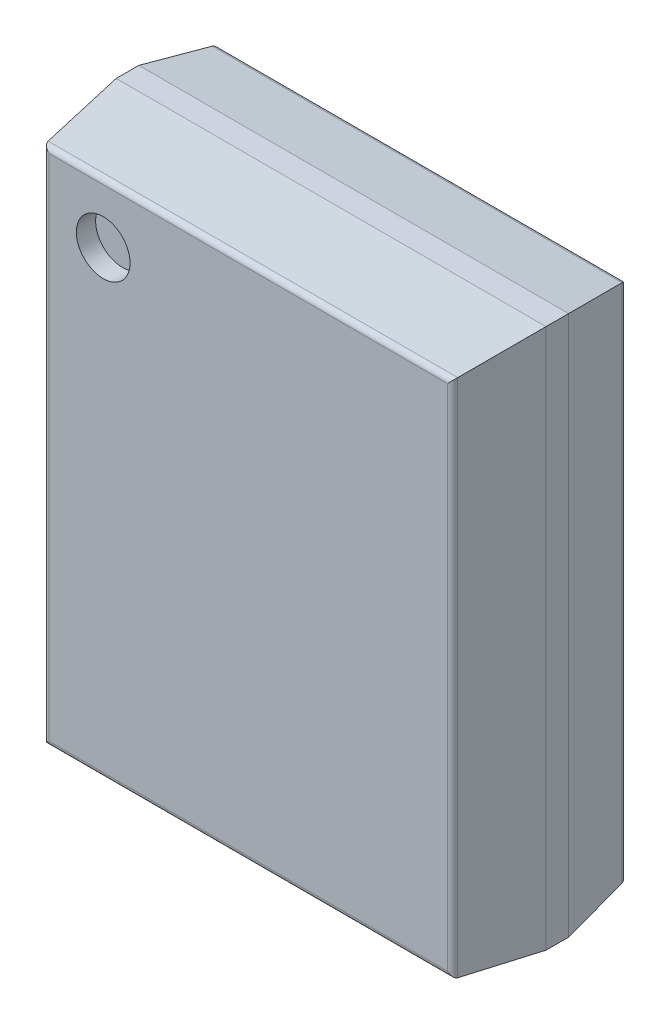
ISO-10303-21;
HEADER;
FILE_DESCRIPTION(('STEP AP214'),'2;1');
FILE_NAME('part.step','',(''),(''),'','','');
FILE_SCHEMA(('AUTOMOTIVE_DESIGN { 1 0 10303 214 1 1 1 1 }'));
ENDSEC;
DATA;
#1=APPLICATION_CONTEXT('core data for automotive mechanical design processes');
#2=APPLICATION_PROTOCOL_DEFINITION('international standard','automotive_design',2000,#1);
#3=PRODUCT_CONTEXT('',#1,'mechanical');
#4=PRODUCT('Part','Part','',(#3));
#5=PRODUCT_RELATED_PRODUCT_CATEGORY('part','',(#4));
#6=PRODUCT_DEFINITION_FORMATION('','',#4);
#7=PRODUCT_DEFINITION_CONTEXT('part definition',#1,'design');
#8=PRODUCT_DEFINITION('design','',#6,#7);
#9=PRODUCT_DEFINITION_SHAPE('','',#8);
#10=(LENGTH_UNIT() NAMED_UNIT(*) SI_UNIT(.MILLI.,.METRE.));
#11=(NAMED_UNIT(*) PLANE_ANGLE_UNIT() SI_UNIT($,.RADIAN.));
#12=(NAMED_UNIT(*) SI_UNIT($,.STERADIAN.) SOLID_ANGLE_UNIT());
#13=UNCERTAINTY_MEASURE_WITH_UNIT(LENGTH_MEASURE(1.E-05),#10,'distance_accuracy_value','');
#14=(GEOMETRIC_REPRESENTATION_CONTEXT(3) GLOBAL_UNCERTAINTY_ASSIGNED_CONTEXT((#13)) GLOBAL_UNIT_ASSIGNED_CONTEXT((#10,
#11,#12)) REPRESENTATION_CONTEXT('',''));
#15=CARTESIAN_POINT('',(0.,0.,0.));
#16=DIRECTION('',(0.,0.,1.));
#17=DIRECTION('',(1.,0.,0.));
#18=AXIS2_PLACEMENT_3D('',#15,#16,#17);
#19=CARTESIAN_POINT('',(-1.315,1.815,1.575));
#20=DIRECTION('',(0.,0.,1.));
#21=DIRECTION('',(1.,0.,0.));
#22=AXIS2_PLACEMENT_3D('',#19,#20,#21);
#23=PLANE('',#22);
#24=CARTESIAN_POINT('',(-1.315,1.815,1.575));
#25=DIRECTION('',(0.,0.,1.));
#26=DIRECTION('',(1.,0.,0.));
#27=AXIS2_PLACEMENT_3D('',#24,#25,#26);
#28=CIRCLE('',#27,0.24375);
#29=CARTESIAN_POINT('',(-1.07125,1.815,1.575));
#30=VERTEX_POINT('',#29);
#31=EDGE_CURVE('E11',#30,#30,#28,.T.);
#32=ORIENTED_EDGE('',*,*,#31,.T.);
#33=EDGE_LOOP('',(#32));
#34=FACE_BOUND('',#33,.T.);
#35=ADVANCED_FACE('F17',(#34),#23,.T.);
#36=CARTESIAN_POINT('',(-1.315,1.815,1.575));
#37=DIRECTION('',(0.,0.,1.));
#38=DIRECTION('',(1.,0.,0.));
#39=AXIS2_PLACEMENT_3D('',#36,#37,#38);
#40=CYLINDRICAL_SURFACE('',#39,0.24375);
#41=DIRECTION('',(0.,0.,1.));
#42=VECTOR('',#41,1.);
#43=CARTESIAN_POINT('',(-1.07125,1.815,1.575));
#44=LINE('',#43,#42);
#45=CARTESIAN_POINT('',(-1.07125,1.815,1.75));
#46=VERTEX_POINT('',#45);
#47=EDGE_CURVE('E26',#30,#46,#44,.T.);
#48=ORIENTED_EDGE('',*,*,#47,.T.);
#49=CARTESIAN_POINT('',(-1.315,1.815,1.75));
#50=DIRECTION('',(0.,0.,1.));
#51=DIRECTION('',(1.,0.,0.));
#52=AXIS2_PLACEMENT_3D('',#49,#50,#51);
#53=CIRCLE('',#52,0.24375);
#54=EDGE_CURVE('E252',#46,#46,#53,.T.);
#55=ORIENTED_EDGE('',*,*,#54,.T.);
#56=ORIENTED_EDGE('',*,*,#47,.F.);
#57=ORIENTED_EDGE('',*,*,#31,.F.);
#58=EDGE_LOOP('',(#48,#55,#56,#57));
#59=FACE_BOUND('',#58,.T.);
#60=ADVANCED_FACE('F518',(#59),#40,.F.);
#61=CARTESIAN_POINT('',(1.808558552786,-2.3525,1.7));
#62=DIRECTION('',(0.,1.,0.));
#63=DIRECTION('',(0.,0.,1.));
#64=AXIS2_PLACEMENT_3D('',#61,#62,#63);
#65=CYLINDRICAL_SURFACE('',#64,0.05);
#66=CARTESIAN_POINT('',(1.808558552786,-2.308558552786,1.7));
#67=DIRECTION('',(-0.707106781186548,-0.707106781186548,0.));
#68=DIRECTION('',(0.707106781186548,-0.707106781186548,0.));
#69=AXIS2_PLACEMENT_3D('',#66,#67,#68);
#70=ELLIPSE('',#69,0.07071067811865,0.05);
#71=CARTESIAN_POINT('',(1.858144342698,-2.358144342698,1.706422572601));
#72=VERTEX_POINT('',#71);
#73=CARTESIAN_POINT('',(1.808558552786,-2.308558552786,1.75));
#74=VERTEX_POINT('',#73);
#75=EDGE_CURVE('E256',#72,#74,#70,.T.);
#76=ORIENTED_EDGE('',*,*,#75,.F.);
#77=DIRECTION('',(0.,1.,0.));
#78=VECTOR('',#77,1.);
#79=CARTESIAN_POINT('',(1.858144342698,-2.3525,1.706422572601));
#80=LINE('',#79,#78);
#81=CARTESIAN_POINT('',(1.858144342698,2.358144342698,1.706422572601));
#82=VERTEX_POINT('',#81);
#83=EDGE_CURVE('E229',#72,#82,#80,.T.);
#84=ORIENTED_EDGE('',*,*,#83,.T.);
#85=CARTESIAN_POINT('',(1.808558552786,2.308558552786,1.7));
#86=DIRECTION('',(-0.707106781186548,0.707106781186548,0.));
#87=DIRECTION('',(0.707106781186548,0.707106781186548,0.));
#88=AXIS2_PLACEMENT_3D('',#85,#86,#87);
#89=ELLIPSE('',#88,0.07071067811865,0.05);
#90=CARTESIAN_POINT('',(1.808558552786,2.308558552786,1.75));
#91=VERTEX_POINT('',#90);
#92=EDGE_CURVE('E249',#91,#82,#89,.T.);
#93=ORIENTED_EDGE('',*,*,#92,.F.);
#94=DIRECTION('',(0.,1.,0.));
#95=VECTOR('',#94,1.);
#96=CARTESIAN_POINT('',(1.808558552786,-2.3525,1.75));
#97=LINE('',#96,#95);
#98=EDGE_CURVE('E323',#74,#91,#97,.T.);
#99=ORIENTED_EDGE('',*,*,#98,.F.);
#100=EDGE_LOOP('',(#76,#84,#93,#99));
#101=FACE_BOUND('',#100,.T.);
#102=ADVANCED_FACE('F19',(#101),#65,.T.);
#103=CARTESIAN_POINT('',(-1.8525,2.308558552786,1.7));
#104=DIRECTION('',(1.,0.,0.));
#105=DIRECTION('',(0.,0.,1.));
#106=AXIS2_PLACEMENT_3D('',#103,#104,#105);
#107=CYLINDRICAL_SURFACE('',#106,0.05);
#108=DIRECTION('',(1.,0.,0.));
#109=VECTOR('',#108,1.);
#110=CARTESIAN_POINT('',(-1.8525,2.308558552786,1.75));
#111=LINE('',#110,#109);
#112=CARTESIAN_POINT('',(-1.808558552786,2.308558552786,1.75));
#113=VERTEX_POINT('',#112);
#114=EDGE_CURVE('E327',#113,#91,#111,.T.);
#115=ORIENTED_EDGE('',*,*,#114,.T.);
#116=ORIENTED_EDGE('',*,*,#92,.T.);
#117=DIRECTION('',(1.,0.,0.));
#118=VECTOR('',#117,1.);
#119=CARTESIAN_POINT('',(-1.8525,2.358144342698,1.706422572601));
#120=LINE('',#119,#118);
#121=CARTESIAN_POINT('',(-1.858144342698,2.358144342698,1.706422572601));
#122=VERTEX_POINT('',#121);
#123=EDGE_CURVE('E230',#122,#82,#120,.T.);
#124=ORIENTED_EDGE('',*,*,#123,.F.);
#125=CARTESIAN_POINT('',(-1.808558552786,2.308558552786,1.7));
#126=DIRECTION('',(0.707106781186548,0.707106781186548,0.));
#127=DIRECTION('',(-0.707106781186548,0.707106781186548,0.));
#128=AXIS2_PLACEMENT_3D('',#125,#126,#127);
#129=ELLIPSE('',#128,0.07071067811865,0.05);
#130=EDGE_CURVE('E312',#122,#113,#129,.T.);
#131=ORIENTED_EDGE('',*,*,#130,.T.);
#132=EDGE_LOOP('',(#115,#116,#124,#131));
#133=FACE_BOUND('',#132,.T.);
#134=ADVANCED_FACE('F503',(#133),#107,.T.);
#135=CARTESIAN_POINT('',(-1.95,-2.45,1.75));
#136=DIRECTION('',(0.,0.,1.));
#137=DIRECTION('',(1.,0.,0.));
#138=AXIS2_PLACEMENT_3D('',#135,#136,#137);
#139=PLANE('',#138);
#140=ORIENTED_EDGE('',*,*,#54,.F.);
#141=EDGE_LOOP('',(#140));
#142=FACE_BOUND('',#141,.T.);
#143=DIRECTION('',(0.,1.,0.));
#144=VECTOR('',#143,1.);
#145=CARTESIAN_POINT('',(-1.808558552786,-2.3525,1.75));
#146=LINE('',#145,#144);
#147=CARTESIAN_POINT('',(-1.808558552786,-2.308558552786,1.75));
#148=VERTEX_POINT('',#147);
#149=EDGE_CURVE('E308',#148,#113,#146,.T.);
#150=ORIENTED_EDGE('',*,*,#149,.F.);
#151=DIRECTION('',(1.,0.,0.));
#152=VECTOR('',#151,1.);
#153=CARTESIAN_POINT('',(-1.8525,-2.308558552786,1.75));
#154=LINE('',#153,#152);
#155=EDGE_CURVE('E322',#148,#74,#154,.T.);
#156=ORIENTED_EDGE('',*,*,#155,.T.);
#157=ORIENTED_EDGE('',*,*,#98,.T.);
#158=ORIENTED_EDGE('',*,*,#114,.F.);
#159=EDGE_LOOP('',(#150,#156,#157,#158));
#160=FACE_BOUND('',#159,.T.);
#161=ADVANCED_FACE('F506',(#142,#160),#139,.T.);
#162=CARTESIAN_POINT('',(-1.8525,-2.308558552786,1.7));
#163=DIRECTION('',(1.,0.,0.));
#164=DIRECTION('',(0.,-0.991715798237691,0.12845145201896));
#165=AXIS2_PLACEMENT_3D('',#162,#163,#164);
#166=CYLINDRICAL_SURFACE('',#165,0.05);
#167=DIRECTION('',(1.,0.,0.));
#168=VECTOR('',#167,1.);
#169=CARTESIAN_POINT('',(-1.8525,-2.358144342698,1.706422572601));
#170=LINE('',#169,#168);
#171=CARTESIAN_POINT('',(-1.858144342698,-2.358144342698,1.706422572601));
#172=VERTEX_POINT('',#171);
#173=EDGE_CURVE('E211',#172,#72,#170,.T.);
#174=ORIENTED_EDGE('',*,*,#173,.T.);
#175=ORIENTED_EDGE('',*,*,#75,.T.);
#176=ORIENTED_EDGE('',*,*,#155,.F.);
#177=CARTESIAN_POINT('',(-1.808558552786,-2.308558552786,1.7));
#178=DIRECTION('',(-0.707106781186548,0.707106781186548,0.));
#179=DIRECTION('',(0.707106781186548,0.707106781186548,0.));
#180=AXIS2_PLACEMENT_3D('',#177,#178,#179);
#181=ELLIPSE('',#180,0.07071067811865,0.05);
#182=EDGE_CURVE('E215',#172,#148,#181,.T.);
#183=ORIENTED_EDGE('',*,*,#182,.F.);
#184=EDGE_LOOP('',(#174,#175,#176,#183));
#185=FACE_BOUND('',#184,.T.);
#186=ADVANCED_FACE('F497',(#185),#166,.T.);
#187=CARTESIAN_POINT('',(1.90125,-2.45,1.373623210137));
#188=DIRECTION('',(0.991715798237691,0.,0.12845145201896));
#189=DIRECTION('',(0.,-1.,0.));
#190=AXIS2_PLACEMENT_3D('',#187,#188,#189);
#191=PLANE('',#190);
#192=DIRECTION('',(-0.12740467794397,0.12740467794397,0.983634127140771));
#193=VECTOR('',#192,1.);
#194=CARTESIAN_POINT('',(1.870389001332,-2.370389001332,1.611887079072));
#195=LINE('',#194,#193);
#196=CARTESIAN_POINT('',(1.95,-2.45,0.997246420274));
#197=VERTEX_POINT('',#196);
#198=EDGE_CURVE('E216',#197,#72,#195,.T.);
#199=ORIENTED_EDGE('',*,*,#198,.F.);
#200=DIRECTION('',(0.,1.,0.));
#201=VECTOR('',#200,1.);
#202=CARTESIAN_POINT('',(1.95,-2.45,0.997246420274));
#203=LINE('',#202,#201);
#204=CARTESIAN_POINT('',(1.95,2.45,0.997246420274));
#205=VERTEX_POINT('',#204);
#206=EDGE_CURVE('E298',#197,#205,#203,.T.);
#207=ORIENTED_EDGE('',*,*,#206,.T.);
#208=DIRECTION('',(-0.12740467794397,-0.12740467794397,0.983634127140771));
#209=VECTOR('',#208,1.);
#210=CARTESIAN_POINT('',(1.830620719025,2.330620719025,1.91892007257));
#211=LINE('',#210,#209);
#212=EDGE_CURVE('E226',#205,#82,#211,.T.);
#213=ORIENTED_EDGE('',*,*,#212,.T.);
#214=ORIENTED_EDGE('',*,*,#83,.F.);
#215=EDGE_LOOP('',(#199,#207,#213,#214));
#216=FACE_BOUND('',#215,.T.);
#217=ADVANCED_FACE('F489',(#216),#191,.T.);
#218=CARTESIAN_POINT('',(-1.95,2.40125,1.373623210137));
#219=DIRECTION('',(0.,0.991715798237691,0.12845145201896));
#220=DIRECTION('',(1.,0.,0.));
#221=AXIS2_PLACEMENT_3D('',#218,#219,#220);
#222=PLANE('',#221);
#223=ORIENTED_EDGE('',*,*,#123,.T.);
#224=ORIENTED_EDGE('',*,*,#212,.F.);
#225=DIRECTION('',(1.,0.,0.));
#226=VECTOR('',#225,1.);
#227=CARTESIAN_POINT('',(-1.95,2.45,0.997246420274));
#228=LINE('',#227,#226);
#229=CARTESIAN_POINT('',(-1.95,2.45,0.997246420274));
#230=VERTEX_POINT('',#229);
#231=EDGE_CURVE('E294',#230,#205,#228,.T.);
#232=ORIENTED_EDGE('',*,*,#231,.F.);
#233=DIRECTION('',(0.12740467794397,-0.12740467794397,0.983634127140771));
#234=VECTOR('',#233,1.);
#235=CARTESIAN_POINT('',(-1.862273025351,2.362273025351,1.674546873663));
#236=LINE('',#235,#234);
#237=EDGE_CURVE('E282',#230,#122,#236,.T.);
#238=ORIENTED_EDGE('',*,*,#237,.T.);
#239=EDGE_LOOP('',(#223,#224,#232,#238));
#240=FACE_BOUND('',#239,.T.);
#241=ADVANCED_FACE('F485',(#240),#222,.T.);
#242=CARTESIAN_POINT('',(-1.808558552786,-2.3525,1.7));
#243=DIRECTION('',(0.,1.,0.));
#244=DIRECTION('',(-0.991715798237691,0.,0.12845145201896));
#245=AXIS2_PLACEMENT_3D('',#242,#243,#244);
#246=CYLINDRICAL_SURFACE('',#245,0.05);
#247=ORIENTED_EDGE('',*,*,#182,.T.);
#248=ORIENTED_EDGE('',*,*,#149,.T.);
#249=ORIENTED_EDGE('',*,*,#130,.F.);
#250=DIRECTION('',(0.,1.,0.));
#251=VECTOR('',#250,1.);
#252=CARTESIAN_POINT('',(-1.858144342698,-2.3525,1.706422572601));
#253=LINE('',#252,#251);
#254=EDGE_CURVE('E278',#172,#122,#253,.T.);
#255=ORIENTED_EDGE('',*,*,#254,.F.);
#256=EDGE_LOOP('',(#247,#248,#249,#255));
#257=FACE_BOUND('',#256,.T.);
#258=ADVANCED_FACE('F500',(#257),#246,.T.);
#259=CARTESIAN_POINT('',(-1.95,-2.40125,1.373623210137));
#260=DIRECTION('',(0.,0.991715798237691,-0.12845145201896));
#261=DIRECTION('',(-1.,0.,0.));
#262=AXIS2_PLACEMENT_3D('',#259,#260,#261);
#263=PLANE('',#262);
#264=DIRECTION('',(0.12740467794397,0.12740467794397,0.983634127140771));
#265=VECTOR('',#264,1.);
#266=CARTESIAN_POINT('',(-1.902041307658,-2.402041307658,1.367513880164));
#267=LINE('',#266,#265);
#268=CARTESIAN_POINT('',(-1.95,-2.45,0.997246420274));
#269=VERTEX_POINT('',#268);
#270=EDGE_CURVE('E286',#269,#172,#267,.T.);
#271=ORIENTED_EDGE('',*,*,#270,.F.);
#272=DIRECTION('',(1.,0.,0.));
#273=VECTOR('',#272,1.);
#274=CARTESIAN_POINT('',(-1.95,-2.45,0.997246420274));
#275=LINE('',#274,#273);
#276=EDGE_CURVE('E149',#269,#197,#275,.T.);
#277=ORIENTED_EDGE('',*,*,#276,.T.);
#278=ORIENTED_EDGE('',*,*,#198,.T.);
#279=ORIENTED_EDGE('',*,*,#173,.F.);
#280=EDGE_LOOP('',(#271,#277,#278,#279));
#281=FACE_BOUND('',#280,.T.);
#282=ADVANCED_FACE('F494',(#281),#263,.F.);
#283=CARTESIAN_POINT('',(1.95,-2.45,0.175));
#284=DIRECTION('',(1.,0.,0.));
#285=DIRECTION('',(0.,1.,0.));
#286=AXIS2_PLACEMENT_3D('',#283,#284,#285);
#287=PLANE('',#286);
#288=DIRECTION('',(0.,0.,1.));
#289=VECTOR('',#288,1.);
#290=CARTESIAN_POINT('',(1.95,-2.45,0.175));
#291=LINE('',#290,#289);
#292=CARTESIAN_POINT('',(1.95,-2.45,0.792246420274));
#293=VERTEX_POINT('',#292);
#294=EDGE_CURVE('E248',#293,#197,#291,.T.);
#295=ORIENTED_EDGE('',*,*,#294,.F.);
#296=DIRECTION('',(0.,1.,0.));
#297=VECTOR('',#296,1.);
#298=CARTESIAN_POINT('',(1.95,-2.45,0.792246420274));
#299=LINE('',#298,#297);
#300=CARTESIAN_POINT('',(1.95,2.45,0.792246420274));
#301=VERTEX_POINT('',#300);
#302=EDGE_CURVE('E263',#293,#301,#299,.T.);
#303=ORIENTED_EDGE('',*,*,#302,.T.);
#304=DIRECTION('',(0.,0.,1.));
#305=VECTOR('',#304,1.);
#306=CARTESIAN_POINT('',(1.95,2.45,0.175));
#307=LINE('',#306,#305);
#308=EDGE_CURVE('E290',#301,#205,#307,.T.);
#309=ORIENTED_EDGE('',*,*,#308,.T.);
#310=ORIENTED_EDGE('',*,*,#206,.F.);
#311=EDGE_LOOP('',(#295,#303,#309,#310));
#312=FACE_BOUND('',#311,.T.);
#313=ADVANCED_FACE('F492',(#312),#287,.T.);
#314=CARTESIAN_POINT('',(1.809778042507,-2.3525,0.225));
#315=DIRECTION('',(0.,1.,0.));
#316=DIRECTION('',(0.,0.,-1.));
#317=AXIS2_PLACEMENT_3D('',#314,#315,#316);
#318=CYLINDRICAL_SURFACE('',#317,0.05);
#319=DIRECTION('',(0.,1.,0.));
#320=VECTOR('',#319,1.);
#321=CARTESIAN_POINT('',(1.809778042507,-2.3525,0.175));
#322=LINE('',#321,#320);
#323=CARTESIAN_POINT('',(1.809778042507,-2.309778042507,0.175));
#324=VERTEX_POINT('',#323);
#325=CARTESIAN_POINT('',(1.809778042507,2.309778042507,0.175));
#326=VERTEX_POINT('',#325);
#327=EDGE_CURVE('E271',#324,#326,#322,.T.);
#328=ORIENTED_EDGE('',*,*,#327,.T.);
#329=CARTESIAN_POINT('',(1.809778042507,2.309778042507,0.225));
#330=DIRECTION('',(0.707106781186548,-0.707106781186548,0.));
#331=DIRECTION('',(0.707106781186548,0.707106781186548,0.));
#332=AXIS2_PLACEMENT_3D('',#329,#330,#331);
#333=ELLIPSE('',#332,0.07071067811865,0.05);
#334=CARTESIAN_POINT('',(1.859165697143,2.359165697143,0.217198745641));
#335=VERTEX_POINT('',#334);
#336=EDGE_CURVE('E275',#326,#335,#333,.T.);
#337=ORIENTED_EDGE('',*,*,#336,.T.);
#338=DIRECTION('',(0.,1.,0.));
#339=VECTOR('',#338,1.);
#340=CARTESIAN_POINT('',(1.859165697143,-2.3525,0.217198745641));
#341=LINE('',#340,#339);
#342=CARTESIAN_POINT('',(1.859165697143,-2.359165697143,0.217198745641));
#343=VERTEX_POINT('',#342);
#344=EDGE_CURVE('E259',#343,#335,#341,.T.);
#345=ORIENTED_EDGE('',*,*,#344,.F.);
#346=CARTESIAN_POINT('',(1.809778042507,-2.309778042507,0.225));
#347=DIRECTION('',(0.707106781186548,0.707106781186548,0.));
#348=DIRECTION('',(0.707106781186548,-0.707106781186548,0.));
#349=AXIS2_PLACEMENT_3D('',#346,#347,#348);
#350=ELLIPSE('',#349,0.07071067811865,0.05);
#351=EDGE_CURVE('E242',#343,#324,#350,.T.);
#352=ORIENTED_EDGE('',*,*,#351,.T.);
#353=EDGE_LOOP('',(#328,#337,#345,#352));
#354=FACE_BOUND('',#353,.T.);
#355=ADVANCED_FACE('F535',(#354),#318,.T.);
#356=CARTESIAN_POINT('',(-1.95,2.45,0.175));
#357=DIRECTION('',(0.,1.,0.));
#358=DIRECTION('',(1.,0.,0.));
#359=AXIS2_PLACEMENT_3D('',#356,#357,#358);
#360=PLANE('',#359);
#361=ORIENTED_EDGE('',*,*,#308,.F.);
#362=DIRECTION('',(1.,0.,0.));
#363=VECTOR('',#362,1.);
#364=CARTESIAN_POINT('',(-1.95,2.45,0.792246420274));
#365=LINE('',#364,#363);
#366=CARTESIAN_POINT('',(-1.95,2.45,0.792246420274));
#367=VERTEX_POINT('',#366);
#368=EDGE_CURVE('E155',#367,#301,#365,.T.);
#369=ORIENTED_EDGE('',*,*,#368,.F.);
#370=DIRECTION('',(0.,0.,1.));
#371=VECTOR('',#370,1.);
#372=CARTESIAN_POINT('',(-1.95,2.45,0.175));
#373=LINE('',#372,#371);
#374=EDGE_CURVE('E156',#367,#230,#373,.T.);
#375=ORIENTED_EDGE('',*,*,#374,.T.);
#376=ORIENTED_EDGE('',*,*,#231,.T.);
#377=EDGE_LOOP('',(#361,#369,#375,#376));
#378=FACE_BOUND('',#377,.T.);
#379=ADVANCED_FACE('F479',(#378),#360,.T.);
#380=CARTESIAN_POINT('',(-1.90125,-2.45,1.373623210137));
#381=DIRECTION('',(0.991715798237691,0.,-0.12845145201896));
#382=DIRECTION('',(0.,-1.,0.));
#383=AXIS2_PLACEMENT_3D('',#380,#381,#382);
#384=PLANE('',#383);
#385=ORIENTED_EDGE('',*,*,#254,.T.);
#386=ORIENTED_EDGE('',*,*,#237,.F.);
#387=DIRECTION('',(0.,1.,0.));
#388=VECTOR('',#387,1.);
#389=CARTESIAN_POINT('',(-1.95,-2.45,0.997246420274));
#390=LINE('',#389,#388);
#391=EDGE_CURVE('E223',#269,#230,#390,.T.);
#392=ORIENTED_EDGE('',*,*,#391,.F.);
#393=ORIENTED_EDGE('',*,*,#270,.T.);
#394=EDGE_LOOP('',(#385,#386,#392,#393));
#395=FACE_BOUND('',#394,.T.);
#396=ADVANCED_FACE('F482',(#395),#384,.F.);
#397=CARTESIAN_POINT('',(-1.8525,2.309778042507,0.225));
#398=DIRECTION('',(1.,0.,0.));
#399=DIRECTION('',(0.,0.,-1.));
#400=AXIS2_PLACEMENT_3D('',#397,#398,#399);
#401=CYLINDRICAL_SURFACE('',#400,0.05);
#402=CARTESIAN_POINT('',(-1.809778042507,2.309778042507,0.225));
#403=DIRECTION('',(-0.707106781186548,-0.707106781186548,0.));
#404=DIRECTION('',(-0.707106781186548,0.707106781186548,0.));
#405=AXIS2_PLACEMENT_3D('',#402,#403,#404);
#406=ELLIPSE('',#405,0.07071067811865,0.05);
#407=CARTESIAN_POINT('',(-1.859165697143,2.359165697143,0.217198745641));
#408=VERTEX_POINT('',#407);
#409=CARTESIAN_POINT('',(-1.809778042507,2.309778042507,0.175));
#410=VERTEX_POINT('',#409);
#411=EDGE_CURVE('E167',#408,#410,#406,.T.);
#412=ORIENTED_EDGE('',*,*,#411,.F.);
#413=DIRECTION('',(1.,0.,0.));
#414=VECTOR('',#413,1.);
#415=CARTESIAN_POINT('',(-1.8525,2.359165697143,0.217198745641));
#416=LINE('',#415,#414);
#417=EDGE_CURVE('E203',#408,#335,#416,.T.);
#418=ORIENTED_EDGE('',*,*,#417,.T.);
#419=ORIENTED_EDGE('',*,*,#336,.F.);
#420=DIRECTION('',(1.,0.,0.));
#421=VECTOR('',#420,1.);
#422=CARTESIAN_POINT('',(-1.8525,2.309778042507,0.175));
#423=LINE('',#422,#421);
#424=EDGE_CURVE('E267',#410,#326,#423,.T.);
#425=ORIENTED_EDGE('',*,*,#424,.F.);
#426=EDGE_LOOP('',(#412,#418,#419,#425));
#427=FACE_BOUND('',#426,.T.);
#428=ADVANCED_FACE('F526',(#427),#401,.T.);
#429=CARTESIAN_POINT('',(-1.95,-2.45,0.175));
#430=DIRECTION('',(0.,0.,1.));
#431=DIRECTION('',(1.,0.,0.));
#432=AXIS2_PLACEMENT_3D('',#429,#430,#431);
#433=PLANE('',#432);
#434=ORIENTED_EDGE('',*,*,#424,.T.);
#435=ORIENTED_EDGE('',*,*,#327,.F.);
#436=DIRECTION('',(1.,0.,0.));
#437=VECTOR('',#436,1.);
#438=CARTESIAN_POINT('',(-1.8525,-2.309778042507,0.175));
#439=LINE('',#438,#437);
#440=CARTESIAN_POINT('',(-1.809778042507,-2.309778042507,0.175));
#441=VERTEX_POINT('',#440);
#442=EDGE_CURVE('E238',#441,#324,#439,.T.);
#443=ORIENTED_EDGE('',*,*,#442,.F.);
#444=DIRECTION('',(0.,1.,0.));
#445=VECTOR('',#444,1.);
#446=CARTESIAN_POINT('',(-1.809778042507,-2.3525,0.175));
#447=LINE('',#446,#445);
#448=EDGE_CURVE('E204',#441,#410,#447,.T.);
#449=ORIENTED_EDGE('',*,*,#448,.T.);
#450=EDGE_LOOP('',(#434,#435,#443,#449));
#451=FACE_BOUND('',#450,.T.);
#452=ADVANCED_FACE('F531',(#451),#433,.F.);
#453=CARTESIAN_POINT('',(1.90125,-2.45,0.483623210137));
#454=DIRECTION('',(-0.987753092714965,0.,0.156025087187994));
#455=DIRECTION('',(0.,1.,0.));
#456=AXIS2_PLACEMENT_3D('',#453,#454,#455);
#457=PLANE('',#456);
#458=ORIENTED_EDGE('',*,*,#344,.T.);
#459=DIRECTION('',(-0.154159948465985,-0.154159948465985,-0.975945398358909));
#460=VECTOR('',#459,1.);
#461=CARTESIAN_POINT('',(1.797841283145,2.297841283145,-0.171029716054));
#462=LINE('',#461,#460);
#463=EDGE_CURVE('E199',#301,#335,#462,.T.);
#464=ORIENTED_EDGE('',*,*,#463,.F.);
#465=ORIENTED_EDGE('',*,*,#302,.F.);
#466=DIRECTION('',(-0.154159948465985,0.154159948465985,-0.975945398358909));
#467=VECTOR('',#466,1.);
#468=CARTESIAN_POINT('',(1.856066242937,-2.356066242937,0.197576930121));
#469=LINE('',#468,#467);
#470=EDGE_CURVE('E165',#293,#343,#469,.T.);
#471=ORIENTED_EDGE('',*,*,#470,.T.);
#472=EDGE_LOOP('',(#458,#464,#465,#471));
#473=FACE_BOUND('',#472,.T.);
#474=ADVANCED_FACE('F528',(#473),#457,.F.);
#475=CARTESIAN_POINT('',(-1.95,-2.45,0.175));
#476=DIRECTION('',(0.,1.,0.));
#477=DIRECTION('',(1.,0.,0.));
#478=AXIS2_PLACEMENT_3D('',#475,#476,#477);
#479=PLANE('',#478);
#480=ORIENTED_EDGE('',*,*,#276,.F.);
#481=DIRECTION('',(0.,0.,1.));
#482=VECTOR('',#481,1.);
#483=CARTESIAN_POINT('',(-1.95,-2.45,0.175));
#484=LINE('',#483,#482);
#485=CARTESIAN_POINT('',(-1.95,-2.45,0.792246420274));
#486=VERTEX_POINT('',#485);
#487=EDGE_CURVE('E142',#486,#269,#484,.T.);
#488=ORIENTED_EDGE('',*,*,#487,.F.);
#489=DIRECTION('',(1.,0.,0.));
#490=VECTOR('',#489,1.);
#491=CARTESIAN_POINT('',(-1.95,-2.45,0.792246420274));
#492=LINE('',#491,#490);
#493=EDGE_CURVE('E146',#486,#293,#492,.T.);
#494=ORIENTED_EDGE('',*,*,#493,.T.);
#495=ORIENTED_EDGE('',*,*,#294,.T.);
#496=EDGE_LOOP('',(#480,#488,#494,#495));
#497=FACE_BOUND('',#496,.T.);
#498=ADVANCED_FACE('F144',(#497),#479,.F.);
#499=CARTESIAN_POINT('',(-1.8525,-2.309778042507,0.225));
#500=DIRECTION('',(1.,0.,0.));
#501=DIRECTION('',(0.,-0.987753092714965,-0.156025087187994));
#502=AXIS2_PLACEMENT_3D('',#499,#500,#501);
#503=CYLINDRICAL_SURFACE('',#502,0.05);
#504=CARTESIAN_POINT('',(-1.809778042507,-2.309778042507,0.225));
#505=DIRECTION('',(0.707106781186548,-0.707106781186548,0.));
#506=DIRECTION('',(0.707106781186548,0.707106781186548,0.));
#507=AXIS2_PLACEMENT_3D('',#504,#505,#506);
#508=ELLIPSE('',#507,0.07071067811865,0.05);
#509=CARTESIAN_POINT('',(-1.859165697143,-2.359165697143,0.217198745641));
#510=VERTEX_POINT('',#509);
#511=EDGE_CURVE('E208',#510,#441,#508,.T.);
#512=ORIENTED_EDGE('',*,*,#511,.T.);
#513=ORIENTED_EDGE('',*,*,#442,.T.);
#514=ORIENTED_EDGE('',*,*,#351,.F.);
#515=DIRECTION('',(1.,0.,0.));
#516=VECTOR('',#515,1.);
#517=CARTESIAN_POINT('',(-1.8525,-2.359165697143,0.217198745641));
#518=LINE('',#517,#516);
#519=EDGE_CURVE('E192',#510,#343,#518,.T.);
#520=ORIENTED_EDGE('',*,*,#519,.F.);
#521=EDGE_LOOP('',(#512,#513,#514,#520));
#522=FACE_BOUND('',#521,.T.);
#523=ADVANCED_FACE('F555',(#522),#503,.T.);
#524=CARTESIAN_POINT('',(-1.95,2.40125,0.483623210137));
#525=DIRECTION('',(0.,-0.987753092714965,0.156025087187994));
#526=DIRECTION('',(-1.,0.,0.));
#527=AXIS2_PLACEMENT_3D('',#524,#525,#526);
#528=PLANE('',#527);
#529=DIRECTION('',(0.154159948465985,-0.154159948465985,-0.975945398358909));
#530=VECTOR('',#529,1.);
#531=CARTESIAN_POINT('',(-1.844183598082,2.344183598082,0.122351083963));
#532=LINE('',#531,#530);
#533=EDGE_CURVE('E178',#367,#408,#532,.T.);
#534=ORIENTED_EDGE('',*,*,#533,.F.);
#535=ORIENTED_EDGE('',*,*,#368,.T.);
#536=ORIENTED_EDGE('',*,*,#463,.T.);
#537=ORIENTED_EDGE('',*,*,#417,.F.);
#538=EDGE_LOOP('',(#534,#535,#536,#537));
#539=FACE_BOUND('',#538,.T.);
#540=ADVANCED_FACE('F556',(#539),#528,.F.);
#541=CARTESIAN_POINT('',(-1.95,-2.45,0.175));
#542=DIRECTION('',(1.,0.,0.));
#543=DIRECTION('',(0.,1.,0.));
#544=AXIS2_PLACEMENT_3D('',#541,#542,#543);
#545=PLANE('',#544);
#546=ORIENTED_EDGE('',*,*,#391,.T.);
#547=ORIENTED_EDGE('',*,*,#374,.F.);
#548=DIRECTION('',(0.,1.,0.));
#549=VECTOR('',#548,1.);
#550=CARTESIAN_POINT('',(-1.95,-2.45,0.792246420274));
#551=LINE('',#550,#549);
#552=EDGE_CURVE('E171',#486,#367,#551,.T.);
#553=ORIENTED_EDGE('',*,*,#552,.F.);
#554=ORIENTED_EDGE('',*,*,#487,.T.);
#555=EDGE_LOOP('',(#546,#547,#553,#554));
#556=FACE_BOUND('',#555,.T.);
#557=ADVANCED_FACE('F172',(#556),#545,.F.);
#558=CARTESIAN_POINT('',(-1.809778042507,-2.3525,0.225));
#559=DIRECTION('',(0.,1.,0.));
#560=DIRECTION('',(-0.987753092714965,0.,-0.156025087187994));
#561=AXIS2_PLACEMENT_3D('',#558,#559,#560);
#562=CYLINDRICAL_SURFACE('',#561,0.05);
#563=DIRECTION('',(0.,1.,0.));
#564=VECTOR('',#563,1.);
#565=CARTESIAN_POINT('',(-1.859165697143,-2.3525,0.217198745641));
#566=LINE('',#565,#564);
#567=EDGE_CURVE('E183',#510,#408,#566,.T.);
#568=ORIENTED_EDGE('',*,*,#567,.T.);
#569=ORIENTED_EDGE('',*,*,#411,.T.);
#570=ORIENTED_EDGE('',*,*,#448,.F.);
#571=ORIENTED_EDGE('',*,*,#511,.F.);
#572=EDGE_LOOP('',(#568,#569,#570,#571));
#573=FACE_BOUND('',#572,.T.);
#574=ADVANCED_FACE('F569',(#573),#562,.T.);
#575=CARTESIAN_POINT('',(-1.95,-2.40125,0.483623210137));
#576=DIRECTION('',(0.,-0.987753092714965,-0.156025087187994));
#577=DIRECTION('',(0.,0.156025087187994,-0.987753092714965));
#578=AXIS2_PLACEMENT_3D('',#575,#576,#577);
#579=PLANE('',#578);
#580=ORIENTED_EDGE('',*,*,#519,.T.);
#581=ORIENTED_EDGE('',*,*,#470,.F.);
#582=ORIENTED_EDGE('',*,*,#493,.F.);
#583=DIRECTION('',(0.154159948465985,0.154159948465985,-0.975945398358909));
#584=VECTOR('',#583,1.);
#585=CARTESIAN_POINT('',(-1.902408557873,-2.402408557873,0.490957730138));
#586=LINE('',#585,#584);
#587=EDGE_CURVE('E163',#486,#510,#586,.T.);
#588=ORIENTED_EDGE('',*,*,#587,.T.);
#589=EDGE_LOOP('',(#580,#581,#582,#588));
#590=FACE_BOUND('',#589,.T.);
#591=ADVANCED_FACE('F161',(#590),#579,.T.);
#592=CARTESIAN_POINT('',(-1.90125,-2.45,0.483623210137));
#593=DIRECTION('',(-0.987753092714965,0.,-0.156025087187994));
#594=DIRECTION('',(-0.156025087187994,0.,0.987753092714965));
#595=AXIS2_PLACEMENT_3D('',#592,#593,#594);
#596=PLANE('',#595);
#597=ORIENTED_EDGE('',*,*,#587,.F.);
#598=ORIENTED_EDGE('',*,*,#552,.T.);
#599=ORIENTED_EDGE('',*,*,#533,.T.);
#600=ORIENTED_EDGE('',*,*,#567,.F.);
#601=EDGE_LOOP('',(#597,#598,#599,#600));
#602=FACE_BOUND('',#601,.T.);
#603=ADVANCED_FACE('F181',(#602),#596,.T.);
#604=CLOSED_SHELL('',(#35,#60,#102,#134,#161,#186,#217,#241,#258,#282,#313,#355,#379,#396,#428,
#452,#474,#498,#523,#540,#557,#574,#591,#603));
#605=MANIFOLD_SOLID_BREP('B1',#604);
#606=ADVANCED_BREP_SHAPE_REPRESENTATION('',(#18,#605),#14);
#607=SHAPE_DEFINITION_REPRESENTATION(#9,#606);
ENDSEC;
END-ISO-10303-21;
